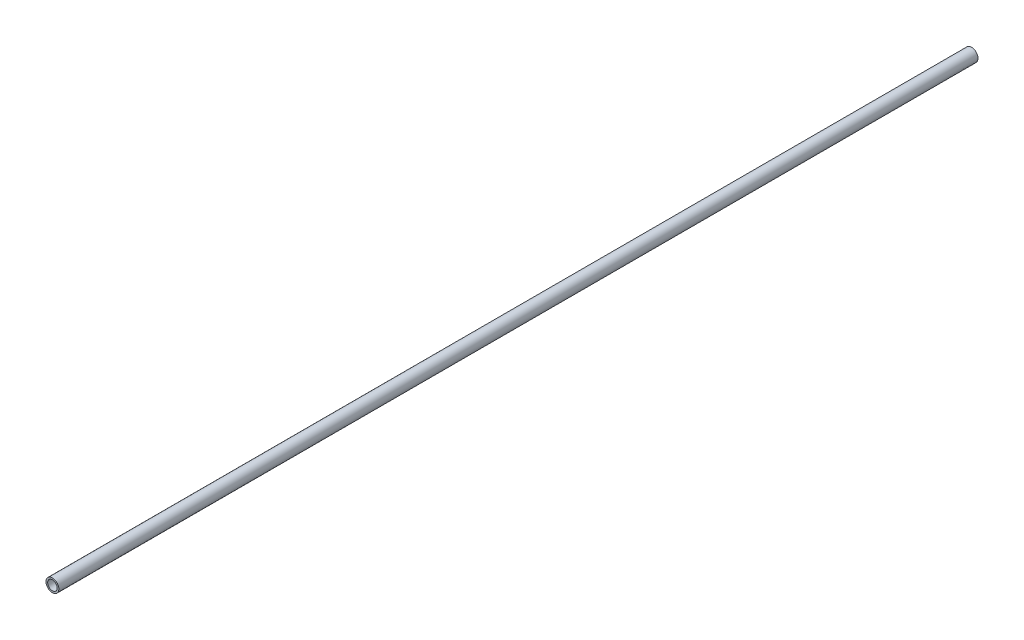
ISO-10303-21;
HEADER;
FILE_DESCRIPTION(('STEP AP214'),'2;1');
FILE_NAME('part.step','',(''),(''),'','','');
FILE_SCHEMA(('AUTOMOTIVE_DESIGN { 1 0 10303 214 1 1 1 1 }'));
ENDSEC;
DATA;
#1=APPLICATION_CONTEXT('core data for automotive mechanical design processes');
#2=APPLICATION_PROTOCOL_DEFINITION('international standard','automotive_design',2000,#1);
#3=PRODUCT_CONTEXT('',#1,'mechanical');
#4=PRODUCT('Part','Part','',(#3));
#5=PRODUCT_RELATED_PRODUCT_CATEGORY('part','',(#4));
#6=PRODUCT_DEFINITION_FORMATION('','',#4);
#7=PRODUCT_DEFINITION_CONTEXT('part definition',#1,'design');
#8=PRODUCT_DEFINITION('design','',#6,#7);
#9=PRODUCT_DEFINITION_SHAPE('','',#8);
#10=(LENGTH_UNIT() NAMED_UNIT(*) SI_UNIT(.MILLI.,.METRE.));
#11=(NAMED_UNIT(*) PLANE_ANGLE_UNIT() SI_UNIT($,.RADIAN.));
#12=(NAMED_UNIT(*) SI_UNIT($,.STERADIAN.) SOLID_ANGLE_UNIT());
#13=UNCERTAINTY_MEASURE_WITH_UNIT(LENGTH_MEASURE(1.E-05),#10,'distance_accuracy_value','');
#14=(GEOMETRIC_REPRESENTATION_CONTEXT(3) GLOBAL_UNCERTAINTY_ASSIGNED_CONTEXT((#13)) GLOBAL_UNIT_ASSIGNED_CONTEXT((#10,
#11,#12)) REPRESENTATION_CONTEXT('',''));
#15=CARTESIAN_POINT('',(0.,0.,0.));
#16=DIRECTION('',(0.,0.,1.));
#17=DIRECTION('',(1.,0.,0.));
#18=AXIS2_PLACEMENT_3D('',#15,#16,#17);
#19=CARTESIAN_POINT('',(0.,0.,762.));
#20=DIRECTION('',(0.,0.,1.));
#21=DIRECTION('',(1.,0.,0.));
#22=AXIS2_PLACEMENT_3D('',#19,#20,#21);
#23=PLANE('',#22);
#24=CARTESIAN_POINT('',(0.,0.,762.));
#25=DIRECTION('',(0.,0.,1.));
#26=DIRECTION('',(1.,0.,0.));
#27=AXIS2_PLACEMENT_3D('',#24,#25,#26);
#28=CIRCLE('',#27,10.668);
#29=CARTESIAN_POINT('',(10.668,0.,762.));
#30=VERTEX_POINT('',#29);
#31=EDGE_CURVE('E11',#30,#30,#28,.T.);
#32=ORIENTED_EDGE('',*,*,#31,.T.);
#33=EDGE_LOOP('',(#32));
#34=FACE_BOUND('',#33,.T.);
#35=CARTESIAN_POINT('',(0.,0.,762.));
#36=DIRECTION('',(0.,0.,1.));
#37=DIRECTION('',(1.,0.,0.));
#38=AXIS2_PLACEMENT_3D('',#35,#36,#37);
#39=CIRCLE('',#38,7.8994);
#40=CARTESIAN_POINT('',(7.8994,0.,762.));
#41=VERTEX_POINT('',#40);
#42=EDGE_CURVE('E46',#41,#41,#39,.T.);
#43=ORIENTED_EDGE('',*,*,#42,.F.);
#44=EDGE_LOOP('',(#43));
#45=FACE_BOUND('',#44,.T.);
#46=ADVANCED_FACE('F35',(#34,#45),#23,.T.);
#47=CARTESIAN_POINT('',(0.,0.,-762.));
#48=DIRECTION('',(0.,0.,1.));
#49=DIRECTION('',(1.,0.,0.));
#50=AXIS2_PLACEMENT_3D('',#47,#48,#49);
#51=PLANE('',#50);
#52=CARTESIAN_POINT('',(0.,0.,-762.));
#53=DIRECTION('',(0.,0.,1.));
#54=DIRECTION('',(1.,0.,0.));
#55=AXIS2_PLACEMENT_3D('',#52,#53,#54);
#56=CIRCLE('',#55,10.668);
#57=CARTESIAN_POINT('',(10.668,0.,-762.));
#58=VERTEX_POINT('',#57);
#59=EDGE_CURVE('E39',#58,#58,#56,.T.);
#60=ORIENTED_EDGE('',*,*,#59,.F.);
#61=EDGE_LOOP('',(#60));
#62=FACE_BOUND('',#61,.T.);
#63=CARTESIAN_POINT('',(0.,0.,-762.));
#64=DIRECTION('',(0.,0.,1.));
#65=DIRECTION('',(1.,0.,0.));
#66=AXIS2_PLACEMENT_3D('',#63,#64,#65);
#67=CIRCLE('',#66,7.8994);
#68=CARTESIAN_POINT('',(7.8994,0.,-762.));
#69=VERTEX_POINT('',#68);
#70=EDGE_CURVE('E48',#69,#69,#67,.T.);
#71=ORIENTED_EDGE('',*,*,#70,.T.);
#72=EDGE_LOOP('',(#71));
#73=FACE_BOUND('',#72,.T.);
#74=ADVANCED_FACE('F58',(#62,#73),#51,.F.);
#75=CARTESIAN_POINT('',(0.,0.,762.));
#76=DIRECTION('',(0.,0.,-1.));
#77=DIRECTION('',(-1.,0.,0.));
#78=AXIS2_PLACEMENT_3D('',#75,#76,#77);
#79=CYLINDRICAL_SURFACE('',#78,10.668);
#80=ORIENTED_EDGE('',*,*,#31,.F.);
#81=EDGE_LOOP('',(#80));
#82=FACE_BOUND('',#81,.T.);
#83=ORIENTED_EDGE('',*,*,#59,.T.);
#84=EDGE_LOOP('',(#83));
#85=FACE_BOUND('',#84,.T.);
#86=ADVANCED_FACE('F37',(#82,#85),#79,.T.);
#87=CARTESIAN_POINT('',(0.,0.,762.));
#88=DIRECTION('',(0.,0.,-1.));
#89=DIRECTION('',(-1.,0.,0.));
#90=AXIS2_PLACEMENT_3D('',#87,#88,#89);
#91=CYLINDRICAL_SURFACE('',#90,7.8994);
#92=ORIENTED_EDGE('',*,*,#42,.T.);
#93=EDGE_LOOP('',(#92));
#94=FACE_BOUND('',#93,.T.);
#95=ORIENTED_EDGE('',*,*,#70,.F.);
#96=EDGE_LOOP('',(#95));
#97=FACE_BOUND('',#96,.T.);
#98=ADVANCED_FACE('F54',(#94,#97),#91,.F.);
#99=CLOSED_SHELL('',(#46,#74,#86,#98));
#100=MANIFOLD_SOLID_BREP('B2',#99);
#101=ADVANCED_BREP_SHAPE_REPRESENTATION('',(#18,#100),#14);
#102=SHAPE_DEFINITION_REPRESENTATION(#9,#101);
ENDSEC;
END-ISO-10303-21;
